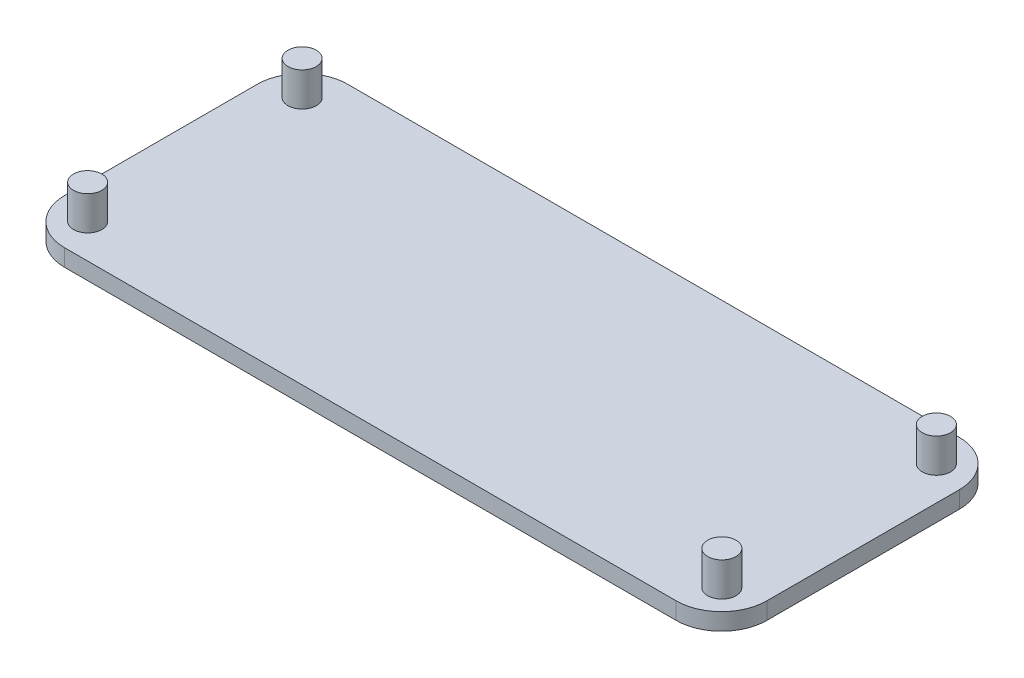
ISO-10303-21;
HEADER;
FILE_DESCRIPTION(('STEP AP214'),'2;1');
FILE_NAME('part.step','',(''),(''),'','','');
FILE_SCHEMA(('AUTOMOTIVE_DESIGN { 1 0 10303 214 1 1 1 1 }'));
ENDSEC;
DATA;
#1=APPLICATION_CONTEXT('core data for automotive mechanical design processes');
#2=APPLICATION_PROTOCOL_DEFINITION('international standard','automotive_design',2000,#1);
#3=PRODUCT_CONTEXT('',#1,'mechanical');
#4=PRODUCT('Part','Part','',(#3));
#5=PRODUCT_RELATED_PRODUCT_CATEGORY('part','',(#4));
#6=PRODUCT_DEFINITION_FORMATION('','',#4);
#7=PRODUCT_DEFINITION_CONTEXT('part definition',#1,'design');
#8=PRODUCT_DEFINITION('design','',#6,#7);
#9=PRODUCT_DEFINITION_SHAPE('','',#8);
#10=(LENGTH_UNIT() NAMED_UNIT(*) SI_UNIT(.MILLI.,.METRE.));
#11=(NAMED_UNIT(*) PLANE_ANGLE_UNIT() SI_UNIT($,.RADIAN.));
#12=(NAMED_UNIT(*) SI_UNIT($,.STERADIAN.) SOLID_ANGLE_UNIT());
#13=UNCERTAINTY_MEASURE_WITH_UNIT(LENGTH_MEASURE(1.E-05),#10,'distance_accuracy_value','');
#14=(GEOMETRIC_REPRESENTATION_CONTEXT(3) GLOBAL_UNCERTAINTY_ASSIGNED_CONTEXT((#13)) GLOBAL_UNIT_ASSIGNED_CONTEXT((#10,
#11,#12)) REPRESENTATION_CONTEXT('',''));
#15=CARTESIAN_POINT('',(0.,0.,0.));
#16=DIRECTION('',(0.,0.,1.));
#17=DIRECTION('',(1.,0.,0.));
#18=AXIS2_PLACEMENT_3D('',#15,#16,#17);
#19=CARTESIAN_POINT('',(0.,1.5,0.));
#20=DIRECTION('',(0.,1.,0.));
#21=DIRECTION('',(0.,0.,1.));
#22=AXIS2_PLACEMENT_3D('',#19,#20,#21);
#23=PLANE('',#22);
#24=CARTESIAN_POINT('',(28.,1.5,9.47));
#25=DIRECTION('',(0.,1.,0.));
#26=DIRECTION('',(0.,0.,1.));
#27=AXIS2_PLACEMENT_3D('',#24,#25,#26);
#28=CIRCLE('',#27,1.25);
#29=CARTESIAN_POINT('',(28.,1.5,10.72));
#30=VERTEX_POINT('',#29);
#31=EDGE_CURVE('E183',#30,#30,#28,.T.);
#32=ORIENTED_EDGE('',*,*,#31,.F.);
#33=EDGE_LOOP('',(#32));
#34=FACE_BOUND('',#33,.T.);
#35=CARTESIAN_POINT('',(-28.,1.5,-9.47));
#36=DIRECTION('',(0.,1.,0.));
#37=DIRECTION('',(0.,0.,1.));
#38=AXIS2_PLACEMENT_3D('',#35,#36,#37);
#39=CIRCLE('',#38,1.25);
#40=CARTESIAN_POINT('',(-28.,1.5,-8.22));
#41=VERTEX_POINT('',#40);
#42=EDGE_CURVE('E166',#41,#41,#39,.T.);
#43=ORIENTED_EDGE('',*,*,#42,.F.);
#44=EDGE_LOOP('',(#43));
#45=FACE_BOUND('',#44,.T.);
#46=DIRECTION('',(0.,0.,1.));
#47=VECTOR('',#46,1.);
#48=CARTESIAN_POINT('',(-31.,1.5,-12.5));
#49=LINE('',#48,#47);
#50=CARTESIAN_POINT('',(-31.,1.5,-8.5));
#51=VERTEX_POINT('',#50);
#52=CARTESIAN_POINT('',(-31.,1.5,8.5));
#53=VERTEX_POINT('',#52);
#54=EDGE_CURVE('E170',#51,#53,#49,.T.);
#55=ORIENTED_EDGE('',*,*,#54,.T.);
#56=CARTESIAN_POINT('',(-27.,1.5,8.5));
#57=DIRECTION('',(0.,1.,0.));
#58=DIRECTION('',(0.,0.,1.));
#59=AXIS2_PLACEMENT_3D('',#56,#57,#58);
#60=CIRCLE('',#59,4.);
#61=CARTESIAN_POINT('',(-27.,1.5,12.5));
#62=VERTEX_POINT('',#61);
#63=EDGE_CURVE('E147',#53,#62,#60,.T.);
#64=ORIENTED_EDGE('',*,*,#63,.T.);
#65=DIRECTION('',(1.,0.,0.));
#66=VECTOR('',#65,1.);
#67=CARTESIAN_POINT('',(-31.,1.5,12.5));
#68=LINE('',#67,#66);
#69=CARTESIAN_POINT('',(27.,1.5,12.5));
#70=VERTEX_POINT('',#69);
#71=EDGE_CURVE('E119',#62,#70,#68,.T.);
#72=ORIENTED_EDGE('',*,*,#71,.T.);
#73=CARTESIAN_POINT('',(27.,1.5,8.5));
#74=DIRECTION('',(0.,1.,0.));
#75=DIRECTION('',(0.,0.,1.));
#76=AXIS2_PLACEMENT_3D('',#73,#74,#75);
#77=CIRCLE('',#76,4.);
#78=CARTESIAN_POINT('',(31.,1.5,8.5));
#79=VERTEX_POINT('',#78);
#80=EDGE_CURVE('E145',#70,#79,#77,.T.);
#81=ORIENTED_EDGE('',*,*,#80,.T.);
#82=DIRECTION('',(0.,0.,-1.));
#83=VECTOR('',#82,1.);
#84=CARTESIAN_POINT('',(31.,1.5,-12.5));
#85=LINE('',#84,#83);
#86=CARTESIAN_POINT('',(31.,1.5,-8.5));
#87=VERTEX_POINT('',#86);
#88=EDGE_CURVE('E125',#79,#87,#85,.T.);
#89=ORIENTED_EDGE('',*,*,#88,.T.);
#90=CARTESIAN_POINT('',(27.,1.5,-8.5));
#91=DIRECTION('',(0.,1.,0.));
#92=DIRECTION('',(0.,0.,1.));
#93=AXIS2_PLACEMENT_3D('',#90,#91,#92);
#94=CIRCLE('',#93,4.);
#95=CARTESIAN_POINT('',(27.,1.5,-12.5));
#96=VERTEX_POINT('',#95);
#97=EDGE_CURVE('E54',#87,#96,#94,.T.);
#98=ORIENTED_EDGE('',*,*,#97,.T.);
#99=DIRECTION('',(-1.,0.,0.));
#100=VECTOR('',#99,1.);
#101=CARTESIAN_POINT('',(-31.,1.5,-12.5));
#102=LINE('',#101,#100);
#103=CARTESIAN_POINT('',(-27.,1.5,-12.5));
#104=VERTEX_POINT('',#103);
#105=EDGE_CURVE('E128',#96,#104,#102,.T.);
#106=ORIENTED_EDGE('',*,*,#105,.T.);
#107=CARTESIAN_POINT('',(-27.,1.5,-8.5));
#108=DIRECTION('',(0.,1.,0.));
#109=DIRECTION('',(0.,0.,1.));
#110=AXIS2_PLACEMENT_3D('',#107,#108,#109);
#111=CIRCLE('',#110,4.);
#112=EDGE_CURVE('E142',#104,#51,#111,.T.);
#113=ORIENTED_EDGE('',*,*,#112,.T.);
#114=EDGE_LOOP('',(#55,#64,#72,#81,#89,#98,#106,#113));
#115=FACE_BOUND('',#114,.T.);
#116=CARTESIAN_POINT('',(28.,1.5,-9.47));
#117=DIRECTION('',(0.,1.,0.));
#118=DIRECTION('',(0.,0.,1.));
#119=AXIS2_PLACEMENT_3D('',#116,#117,#118);
#120=CIRCLE('',#119,1.25);
#121=CARTESIAN_POINT('',(28.,1.5,-8.22));
#122=VERTEX_POINT('',#121);
#123=EDGE_CURVE('E177',#122,#122,#120,.T.);
#124=ORIENTED_EDGE('',*,*,#123,.F.);
#125=EDGE_LOOP('',(#124));
#126=FACE_BOUND('',#125,.T.);
#127=CARTESIAN_POINT('',(-28.,1.5,9.47));
#128=DIRECTION('',(0.,1.,0.));
#129=DIRECTION('',(0.,0.,1.));
#130=AXIS2_PLACEMENT_3D('',#127,#128,#129);
#131=CIRCLE('',#130,1.25);
#132=CARTESIAN_POINT('',(-28.,1.5,10.72));
#133=VERTEX_POINT('',#132);
#134=EDGE_CURVE('E189',#133,#133,#131,.T.);
#135=ORIENTED_EDGE('',*,*,#134,.F.);
#136=EDGE_LOOP('',(#135));
#137=FACE_BOUND('',#136,.T.);
#138=ADVANCED_FACE('F33',(#34,#45,#115,#126,#137),#23,.T.);
#139=CARTESIAN_POINT('',(31.,1.5,-12.5));
#140=DIRECTION('',(-1.,0.,0.));
#141=DIRECTION('',(0.,0.,1.));
#142=AXIS2_PLACEMENT_3D('',#139,#140,#141);
#143=PLANE('',#142);
#144=ORIENTED_EDGE('',*,*,#88,.F.);
#145=DIRECTION('',(0.,-1.,0.));
#146=VECTOR('',#145,1.);
#147=CARTESIAN_POINT('',(31.,1.5,8.5));
#148=LINE('',#147,#146);
#149=CARTESIAN_POINT('',(31.,0.,8.5));
#150=VERTEX_POINT('',#149);
#151=EDGE_CURVE('E151',#79,#150,#148,.T.);
#152=ORIENTED_EDGE('',*,*,#151,.T.);
#153=DIRECTION('',(0.,0.,-1.));
#154=VECTOR('',#153,1.);
#155=CARTESIAN_POINT('',(31.,0.,-12.5));
#156=LINE('',#155,#154);
#157=CARTESIAN_POINT('',(31.,0.,-8.5));
#158=VERTEX_POINT('',#157);
#159=EDGE_CURVE('E158',#150,#158,#156,.T.);
#160=ORIENTED_EDGE('',*,*,#159,.T.);
#161=DIRECTION('',(0.,-1.,0.));
#162=VECTOR('',#161,1.);
#163=CARTESIAN_POINT('',(31.,1.5,-8.5));
#164=LINE('',#163,#162);
#165=EDGE_CURVE('E149',#158,#87,#164,.F.);
#166=ORIENTED_EDGE('',*,*,#165,.T.);
#167=EDGE_LOOP('',(#144,#152,#160,#166));
#168=FACE_BOUND('',#167,.T.);
#169=ADVANCED_FACE('F157',(#168),#143,.F.);
#170=CARTESIAN_POINT('',(-31.,1.5,-12.5));
#171=DIRECTION('',(0.,0.,1.));
#172=DIRECTION('',(1.,0.,0.));
#173=AXIS2_PLACEMENT_3D('',#170,#171,#172);
#174=PLANE('',#173);
#175=ORIENTED_EDGE('',*,*,#105,.F.);
#176=DIRECTION('',(0.,-1.,0.));
#177=VECTOR('',#176,1.);
#178=CARTESIAN_POINT('',(27.,1.5,-12.5));
#179=LINE('',#178,#177);
#180=CARTESIAN_POINT('',(27.,0.,-12.5));
#181=VERTEX_POINT('',#180);
#182=EDGE_CURVE('E11',#96,#181,#179,.T.);
#183=ORIENTED_EDGE('',*,*,#182,.T.);
#184=DIRECTION('',(-1.,0.,0.));
#185=VECTOR('',#184,1.);
#186=CARTESIAN_POINT('',(-31.,0.,-12.5));
#187=LINE('',#186,#185);
#188=CARTESIAN_POINT('',(-27.,0.,-12.5));
#189=VERTEX_POINT('',#188);
#190=EDGE_CURVE('E130',#181,#189,#187,.T.);
#191=ORIENTED_EDGE('',*,*,#190,.T.);
#192=DIRECTION('',(0.,-1.,0.));
#193=VECTOR('',#192,1.);
#194=CARTESIAN_POINT('',(-27.,1.5,-12.5));
#195=LINE('',#194,#193);
#196=EDGE_CURVE('E41',#189,#104,#195,.F.);
#197=ORIENTED_EDGE('',*,*,#196,.T.);
#198=EDGE_LOOP('',(#175,#183,#191,#197));
#199=FACE_BOUND('',#198,.T.);
#200=ADVANCED_FACE('F210',(#199),#174,.F.);
#201=CARTESIAN_POINT('',(-31.,1.5,-12.5));
#202=DIRECTION('',(1.,0.,0.));
#203=DIRECTION('',(0.,0.,-1.));
#204=AXIS2_PLACEMENT_3D('',#201,#202,#203);
#205=PLANE('',#204);
#206=DIRECTION('',(0.,0.,1.));
#207=VECTOR('',#206,1.);
#208=CARTESIAN_POINT('',(-31.,0.,-12.5));
#209=LINE('',#208,#207);
#210=CARTESIAN_POINT('',(-31.,0.,-8.5));
#211=VERTEX_POINT('',#210);
#212=CARTESIAN_POINT('',(-31.,0.,8.5));
#213=VERTEX_POINT('',#212);
#214=EDGE_CURVE('E126',#211,#213,#209,.T.);
#215=ORIENTED_EDGE('',*,*,#214,.T.);
#216=DIRECTION('',(0.,-1.,0.));
#217=VECTOR('',#216,1.);
#218=CARTESIAN_POINT('',(-31.,1.5,8.5));
#219=LINE('',#218,#217);
#220=EDGE_CURVE('E104',#213,#53,#219,.F.);
#221=ORIENTED_EDGE('',*,*,#220,.T.);
#222=ORIENTED_EDGE('',*,*,#54,.F.);
#223=DIRECTION('',(0.,-1.,0.));
#224=VECTOR('',#223,1.);
#225=CARTESIAN_POINT('',(-31.,1.5,-8.5));
#226=LINE('',#225,#224);
#227=EDGE_CURVE('E109',#51,#211,#226,.T.);
#228=ORIENTED_EDGE('',*,*,#227,.T.);
#229=EDGE_LOOP('',(#215,#221,#222,#228));
#230=FACE_BOUND('',#229,.T.);
#231=ADVANCED_FACE('F222',(#230),#205,.F.);
#232=CARTESIAN_POINT('',(-31.,1.5,12.5));
#233=DIRECTION('',(0.,0.,-1.));
#234=DIRECTION('',(-1.,0.,0.));
#235=AXIS2_PLACEMENT_3D('',#232,#233,#234);
#236=PLANE('',#235);
#237=ORIENTED_EDGE('',*,*,#71,.F.);
#238=DIRECTION('',(0.,-1.,0.));
#239=VECTOR('',#238,1.);
#240=CARTESIAN_POINT('',(-27.,1.5,12.5));
#241=LINE('',#240,#239);
#242=CARTESIAN_POINT('',(-27.,0.,12.5));
#243=VERTEX_POINT('',#242);
#244=EDGE_CURVE('E103',#62,#243,#241,.T.);
#245=ORIENTED_EDGE('',*,*,#244,.T.);
#246=DIRECTION('',(1.,0.,0.));
#247=VECTOR('',#246,1.);
#248=CARTESIAN_POINT('',(-31.,0.,12.5));
#249=LINE('',#248,#247);
#250=CARTESIAN_POINT('',(27.,0.,12.5));
#251=VERTEX_POINT('',#250);
#252=EDGE_CURVE('E116',#243,#251,#249,.T.);
#253=ORIENTED_EDGE('',*,*,#252,.T.);
#254=DIRECTION('',(0.,-1.,0.));
#255=VECTOR('',#254,1.);
#256=CARTESIAN_POINT('',(27.,1.5,12.5));
#257=LINE('',#256,#255);
#258=EDGE_CURVE('E121',#251,#70,#257,.F.);
#259=ORIENTED_EDGE('',*,*,#258,.T.);
#260=EDGE_LOOP('',(#237,#245,#253,#259));
#261=FACE_BOUND('',#260,.T.);
#262=ADVANCED_FACE('F115',(#261),#236,.F.);
#263=CARTESIAN_POINT('',(0.,0.,0.));
#264=DIRECTION('',(0.,1.,0.));
#265=DIRECTION('',(0.,0.,1.));
#266=AXIS2_PLACEMENT_3D('',#263,#264,#265);
#267=PLANE('',#266);
#268=ORIENTED_EDGE('',*,*,#252,.F.);
#269=CARTESIAN_POINT('',(-27.,0.,8.5));
#270=DIRECTION('',(0.,1.,0.));
#271=DIRECTION('',(0.,0.,1.));
#272=AXIS2_PLACEMENT_3D('',#269,#270,#271);
#273=CIRCLE('',#272,4.);
#274=EDGE_CURVE('E99',#243,#213,#273,.F.);
#275=ORIENTED_EDGE('',*,*,#274,.T.);
#276=ORIENTED_EDGE('',*,*,#214,.F.);
#277=CARTESIAN_POINT('',(-27.,0.,-8.5));
#278=DIRECTION('',(0.,1.,0.));
#279=DIRECTION('',(0.,0.,1.));
#280=AXIS2_PLACEMENT_3D('',#277,#278,#279);
#281=CIRCLE('',#280,4.);
#282=EDGE_CURVE('E120',#211,#189,#281,.F.);
#283=ORIENTED_EDGE('',*,*,#282,.T.);
#284=ORIENTED_EDGE('',*,*,#190,.F.);
#285=CARTESIAN_POINT('',(27.,0.,-8.5));
#286=DIRECTION('',(0.,1.,0.));
#287=DIRECTION('',(0.,0.,1.));
#288=AXIS2_PLACEMENT_3D('',#285,#286,#287);
#289=CIRCLE('',#288,4.);
#290=EDGE_CURVE('E136',#181,#158,#289,.F.);
#291=ORIENTED_EDGE('',*,*,#290,.T.);
#292=ORIENTED_EDGE('',*,*,#159,.F.);
#293=CARTESIAN_POINT('',(27.,0.,8.5));
#294=DIRECTION('',(0.,1.,0.));
#295=DIRECTION('',(0.,0.,1.));
#296=AXIS2_PLACEMENT_3D('',#293,#294,#295);
#297=CIRCLE('',#296,4.);
#298=EDGE_CURVE('E110',#150,#251,#297,.F.);
#299=ORIENTED_EDGE('',*,*,#298,.T.);
#300=EDGE_LOOP('',(#268,#275,#276,#283,#284,#291,#292,#299));
#301=FACE_BOUND('',#300,.T.);
#302=ADVANCED_FACE('F123',(#301),#267,.F.);
#303=CARTESIAN_POINT('',(-27.,1.5,8.5));
#304=DIRECTION('',(0.,-1.,0.));
#305=DIRECTION('',(0.,0.,-1.));
#306=AXIS2_PLACEMENT_3D('',#303,#304,#305);
#307=CYLINDRICAL_SURFACE('',#306,4.);
#308=ORIENTED_EDGE('',*,*,#63,.F.);
#309=ORIENTED_EDGE('',*,*,#220,.F.);
#310=ORIENTED_EDGE('',*,*,#274,.F.);
#311=ORIENTED_EDGE('',*,*,#244,.F.);
#312=EDGE_LOOP('',(#308,#309,#310,#311));
#313=FACE_BOUND('',#312,.T.);
#314=ADVANCED_FACE('F102',(#313),#307,.T.);
#315=CARTESIAN_POINT('',(27.,1.5,8.5));
#316=DIRECTION('',(0.,-1.,0.));
#317=DIRECTION('',(0.,0.,-1.));
#318=AXIS2_PLACEMENT_3D('',#315,#316,#317);
#319=CYLINDRICAL_SURFACE('',#318,4.);
#320=ORIENTED_EDGE('',*,*,#80,.F.);
#321=ORIENTED_EDGE('',*,*,#258,.F.);
#322=ORIENTED_EDGE('',*,*,#298,.F.);
#323=ORIENTED_EDGE('',*,*,#151,.F.);
#324=EDGE_LOOP('',(#320,#321,#322,#323));
#325=FACE_BOUND('',#324,.T.);
#326=ADVANCED_FACE('F230',(#325),#319,.T.);
#327=CARTESIAN_POINT('',(27.,1.5,-8.5));
#328=DIRECTION('',(0.,-1.,0.));
#329=DIRECTION('',(0.,0.,-1.));
#330=AXIS2_PLACEMENT_3D('',#327,#328,#329);
#331=CYLINDRICAL_SURFACE('',#330,4.);
#332=ORIENTED_EDGE('',*,*,#97,.F.);
#333=ORIENTED_EDGE('',*,*,#165,.F.);
#334=ORIENTED_EDGE('',*,*,#290,.F.);
#335=ORIENTED_EDGE('',*,*,#182,.F.);
#336=EDGE_LOOP('',(#332,#333,#334,#335));
#337=FACE_BOUND('',#336,.T.);
#338=ADVANCED_FACE('F232',(#337),#331,.T.);
#339=CARTESIAN_POINT('',(-27.,1.5,-8.5));
#340=DIRECTION('',(0.,-1.,0.));
#341=DIRECTION('',(0.,0.,-1.));
#342=AXIS2_PLACEMENT_3D('',#339,#340,#341);
#343=CYLINDRICAL_SURFACE('',#342,4.);
#344=ORIENTED_EDGE('',*,*,#112,.F.);
#345=ORIENTED_EDGE('',*,*,#196,.F.);
#346=ORIENTED_EDGE('',*,*,#282,.F.);
#347=ORIENTED_EDGE('',*,*,#227,.F.);
#348=EDGE_LOOP('',(#344,#345,#346,#347));
#349=FACE_BOUND('',#348,.T.);
#350=ADVANCED_FACE('F35',(#349),#343,.T.);
#351=CARTESIAN_POINT('',(-28.,4.5,-9.47));
#352=DIRECTION('',(0.,-1.,0.));
#353=DIRECTION('',(0.,0.,-1.));
#354=AXIS2_PLACEMENT_3D('',#351,#352,#353);
#355=CYLINDRICAL_SURFACE('',#354,1.25);
#356=CARTESIAN_POINT('',(-28.,4.5,-9.47));
#357=DIRECTION('',(0.,1.,0.));
#358=DIRECTION('',(0.,0.,1.));
#359=AXIS2_PLACEMENT_3D('',#356,#357,#358);
#360=CIRCLE('',#359,1.25);
#361=CARTESIAN_POINT('',(-28.,4.5,-8.22));
#362=VERTEX_POINT('',#361);
#363=EDGE_CURVE('E163',#362,#362,#360,.T.);
#364=ORIENTED_EDGE('',*,*,#363,.F.);
#365=EDGE_LOOP('',(#364));
#366=FACE_BOUND('',#365,.T.);
#367=ORIENTED_EDGE('',*,*,#42,.T.);
#368=EDGE_LOOP('',(#367));
#369=FACE_BOUND('',#368,.T.);
#370=ADVANCED_FACE('F216',(#366,#369),#355,.T.);
#371=CARTESIAN_POINT('',(-28.,4.5,-9.47));
#372=DIRECTION('',(0.,1.,0.));
#373=DIRECTION('',(0.,0.,1.));
#374=AXIS2_PLACEMENT_3D('',#371,#372,#373);
#375=PLANE('',#374);
#376=ORIENTED_EDGE('',*,*,#363,.T.);
#377=EDGE_LOOP('',(#376));
#378=FACE_BOUND('',#377,.T.);
#379=ADVANCED_FACE('F249',(#378),#375,.T.);
#380=CARTESIAN_POINT('',(28.,4.5,-9.47));
#381=DIRECTION('',(0.,-1.,0.));
#382=DIRECTION('',(0.,0.,-1.));
#383=AXIS2_PLACEMENT_3D('',#380,#381,#382);
#384=CYLINDRICAL_SURFACE('',#383,1.25);
#385=CARTESIAN_POINT('',(28.,4.5,-9.47));
#386=DIRECTION('',(0.,1.,0.));
#387=DIRECTION('',(0.,0.,1.));
#388=AXIS2_PLACEMENT_3D('',#385,#386,#387);
#389=CIRCLE('',#388,1.25);
#390=CARTESIAN_POINT('',(28.,4.5,-8.22));
#391=VERTEX_POINT('',#390);
#392=EDGE_CURVE('E175',#391,#391,#389,.T.);
#393=ORIENTED_EDGE('',*,*,#392,.F.);
#394=EDGE_LOOP('',(#393));
#395=FACE_BOUND('',#394,.T.);
#396=ORIENTED_EDGE('',*,*,#123,.T.);
#397=EDGE_LOOP('',(#396));
#398=FACE_BOUND('',#397,.T.);
#399=ADVANCED_FACE('F246',(#395,#398),#384,.T.);
#400=CARTESIAN_POINT('',(28.,4.5,-9.47));
#401=DIRECTION('',(0.,1.,0.));
#402=DIRECTION('',(0.,0.,1.));
#403=AXIS2_PLACEMENT_3D('',#400,#401,#402);
#404=PLANE('',#403);
#405=ORIENTED_EDGE('',*,*,#392,.T.);
#406=EDGE_LOOP('',(#405));
#407=FACE_BOUND('',#406,.T.);
#408=ADVANCED_FACE('F248',(#407),#404,.T.);
#409=CARTESIAN_POINT('',(28.,4.5,9.47));
#410=DIRECTION('',(0.,-1.,0.));
#411=DIRECTION('',(0.,0.,-1.));
#412=AXIS2_PLACEMENT_3D('',#409,#410,#411);
#413=CYLINDRICAL_SURFACE('',#412,1.25);
#414=CARTESIAN_POINT('',(28.,4.5,9.47));
#415=DIRECTION('',(0.,1.,0.));
#416=DIRECTION('',(0.,0.,1.));
#417=AXIS2_PLACEMENT_3D('',#414,#415,#416);
#418=CIRCLE('',#417,1.25);
#419=CARTESIAN_POINT('',(28.,4.5,10.72));
#420=VERTEX_POINT('',#419);
#421=EDGE_CURVE('E180',#420,#420,#418,.T.);
#422=ORIENTED_EDGE('',*,*,#421,.F.);
#423=EDGE_LOOP('',(#422));
#424=FACE_BOUND('',#423,.T.);
#425=ORIENTED_EDGE('',*,*,#31,.T.);
#426=EDGE_LOOP('',(#425));
#427=FACE_BOUND('',#426,.T.);
#428=ADVANCED_FACE('F256',(#424,#427),#413,.T.);
#429=CARTESIAN_POINT('',(28.,4.5,9.47));
#430=DIRECTION('',(0.,1.,0.));
#431=DIRECTION('',(0.,0.,1.));
#432=AXIS2_PLACEMENT_3D('',#429,#430,#431);
#433=PLANE('',#432);
#434=ORIENTED_EDGE('',*,*,#421,.T.);
#435=EDGE_LOOP('',(#434));
#436=FACE_BOUND('',#435,.T.);
#437=ADVANCED_FACE('F200',(#436),#433,.T.);
#438=CARTESIAN_POINT('',(-28.,4.5,9.47));
#439=DIRECTION('',(0.,-1.,0.));
#440=DIRECTION('',(0.,0.,-1.));
#441=AXIS2_PLACEMENT_3D('',#438,#439,#440);
#442=CYLINDRICAL_SURFACE('',#441,1.25);
#443=CARTESIAN_POINT('',(-28.,4.5,9.47));
#444=DIRECTION('',(0.,1.,0.));
#445=DIRECTION('',(0.,0.,1.));
#446=AXIS2_PLACEMENT_3D('',#443,#444,#445);
#447=CIRCLE('',#446,1.25);
#448=CARTESIAN_POINT('',(-28.,4.5,10.72));
#449=VERTEX_POINT('',#448);
#450=EDGE_CURVE('E186',#449,#449,#447,.T.);
#451=ORIENTED_EDGE('',*,*,#450,.F.);
#452=EDGE_LOOP('',(#451));
#453=FACE_BOUND('',#452,.T.);
#454=ORIENTED_EDGE('',*,*,#134,.T.);
#455=EDGE_LOOP('',(#454));
#456=FACE_BOUND('',#455,.T.);
#457=ADVANCED_FACE('F197',(#453,#456),#442,.T.);
#458=CARTESIAN_POINT('',(-28.,4.5,9.47));
#459=DIRECTION('',(0.,1.,0.));
#460=DIRECTION('',(0.,0.,1.));
#461=AXIS2_PLACEMENT_3D('',#458,#459,#460);
#462=PLANE('',#461);
#463=ORIENTED_EDGE('',*,*,#450,.T.);
#464=EDGE_LOOP('',(#463));
#465=FACE_BOUND('',#464,.T.);
#466=ADVANCED_FACE('F195',(#465),#462,.T.);
#467=CLOSED_SHELL('',(#138,#169,#200,#231,#262,#302,#314,#326,#338,#350,#370,#379,#399,#408,
#428,#437,#457,#466));
#468=MANIFOLD_SOLID_BREP('B2',#467);
#469=ADVANCED_BREP_SHAPE_REPRESENTATION('',(#18,#468),#14);
#470=SHAPE_DEFINITION_REPRESENTATION(#9,#469);
ENDSEC;
END-ISO-10303-21;
